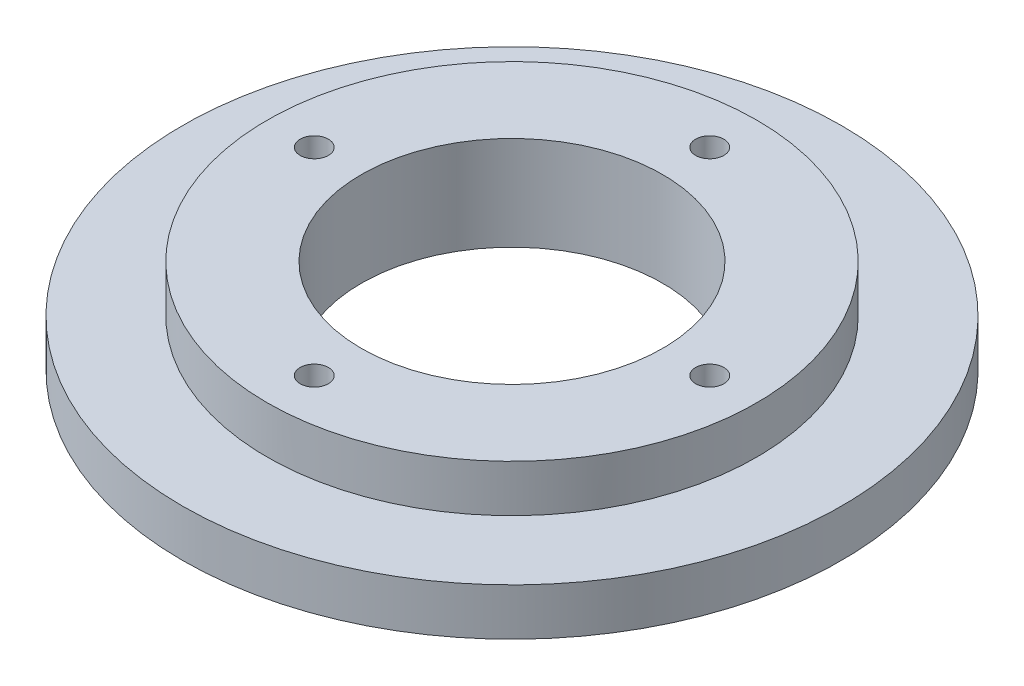
ISO-10303-21;
HEADER;
FILE_DESCRIPTION(('STEP AP214'),'2;1');
FILE_NAME('part.step','',(''),(''),'','','');
FILE_SCHEMA(('AUTOMOTIVE_DESIGN { 1 0 10303 214 1 1 1 1 }'));
ENDSEC;
DATA;
#1=APPLICATION_CONTEXT('core data for automotive mechanical design processes');
#2=APPLICATION_PROTOCOL_DEFINITION('international standard','automotive_design',2000,#1);
#3=PRODUCT_CONTEXT('',#1,'mechanical');
#4=PRODUCT('Part','Part','',(#3));
#5=PRODUCT_RELATED_PRODUCT_CATEGORY('part','',(#4));
#6=PRODUCT_DEFINITION_FORMATION('','',#4);
#7=PRODUCT_DEFINITION_CONTEXT('part definition',#1,'design');
#8=PRODUCT_DEFINITION('design','',#6,#7);
#9=PRODUCT_DEFINITION_SHAPE('','',#8);
#10=(LENGTH_UNIT() NAMED_UNIT(*) SI_UNIT(.MILLI.,.METRE.));
#11=(NAMED_UNIT(*) PLANE_ANGLE_UNIT() SI_UNIT($,.RADIAN.));
#12=(NAMED_UNIT(*) SI_UNIT($,.STERADIAN.) SOLID_ANGLE_UNIT());
#13=UNCERTAINTY_MEASURE_WITH_UNIT(LENGTH_MEASURE(1.E-05),#10,'distance_accuracy_value','');
#14=(GEOMETRIC_REPRESENTATION_CONTEXT(3) GLOBAL_UNCERTAINTY_ASSIGNED_CONTEXT((#13)) GLOBAL_UNIT_ASSIGNED_CONTEXT((#10,
#11,#12)) REPRESENTATION_CONTEXT('',''));
#15=CARTESIAN_POINT('',(0.,0.,0.));
#16=DIRECTION('',(0.,0.,1.));
#17=DIRECTION('',(1.,0.,0.));
#18=AXIS2_PLACEMENT_3D('',#15,#16,#17);
#19=CARTESIAN_POINT('',(21.,-25.,0.));
#20=DIRECTION('',(0.,1.,0.));
#21=DIRECTION('',(0.,0.,1.));
#22=AXIS2_PLACEMENT_3D('',#19,#20,#21);
#23=CYLINDRICAL_SURFACE('',#22,1.5);
#24=CARTESIAN_POINT('',(21.,10.,0.));
#25=DIRECTION('',(0.,1.,0.));
#26=DIRECTION('',(0.,0.,1.));
#27=AXIS2_PLACEMENT_3D('',#24,#25,#26);
#28=CIRCLE('',#27,1.5);
#29=CARTESIAN_POINT('',(21.,10.,1.5));
#30=VERTEX_POINT('',#29);
#31=EDGE_CURVE('E403',#30,#30,#28,.T.);
#32=ORIENTED_EDGE('',*,*,#31,.T.);
#33=EDGE_LOOP('',(#32));
#34=FACE_BOUND('',#33,.T.);
#35=CARTESIAN_POINT('',(21.,3.,0.));
#36=DIRECTION('',(0.,-1.,0.));
#37=DIRECTION('',(0.,0.,-1.));
#38=AXIS2_PLACEMENT_3D('',#35,#36,#37);
#39=CIRCLE('',#38,1.5);
#40=CARTESIAN_POINT('',(21.,3.,-1.5));
#41=VERTEX_POINT('',#40);
#42=EDGE_CURVE('E36',#41,#41,#39,.F.);
#43=ORIENTED_EDGE('',*,*,#42,.F.);
#44=EDGE_LOOP('',(#43));
#45=FACE_BOUND('',#44,.T.);
#46=ADVANCED_FACE('F32',(#34,#45),#23,.F.);
#47=CARTESIAN_POINT('',(-21.,-25.,0.));
#48=DIRECTION('',(0.,1.,0.));
#49=DIRECTION('',(0.,0.,1.));
#50=AXIS2_PLACEMENT_3D('',#47,#48,#49);
#51=CYLINDRICAL_SURFACE('',#50,1.5);
#52=CARTESIAN_POINT('',(-21.,10.,0.));
#53=DIRECTION('',(0.,1.,0.));
#54=DIRECTION('',(0.,0.,1.));
#55=AXIS2_PLACEMENT_3D('',#52,#53,#54);
#56=CIRCLE('',#55,1.5);
#57=CARTESIAN_POINT('',(-21.,10.,1.5));
#58=VERTEX_POINT('',#57);
#59=EDGE_CURVE('E400',#58,#58,#56,.T.);
#60=ORIENTED_EDGE('',*,*,#59,.T.);
#61=EDGE_LOOP('',(#60));
#62=FACE_BOUND('',#61,.T.);
#63=CARTESIAN_POINT('',(-21.,3.,0.));
#64=DIRECTION('',(0.,-1.,0.));
#65=DIRECTION('',(0.,0.,-1.));
#66=AXIS2_PLACEMENT_3D('',#63,#64,#65);
#67=CIRCLE('',#66,1.5);
#68=CARTESIAN_POINT('',(-21.,3.,-1.5));
#69=VERTEX_POINT('',#68);
#70=EDGE_CURVE('E423',#69,#69,#67,.F.);
#71=ORIENTED_EDGE('',*,*,#70,.F.);
#72=EDGE_LOOP('',(#71));
#73=FACE_BOUND('',#72,.T.);
#74=ADVANCED_FACE('F431',(#62,#73),#51,.F.);
#75=CARTESIAN_POINT('',(0.,-25.,-21.));
#76=DIRECTION('',(0.,1.,0.));
#77=DIRECTION('',(0.,0.,1.));
#78=AXIS2_PLACEMENT_3D('',#75,#76,#77);
#79=CYLINDRICAL_SURFACE('',#78,1.5);
#80=CARTESIAN_POINT('',(0.,10.,-21.));
#81=DIRECTION('',(0.,1.,0.));
#82=DIRECTION('',(0.,0.,1.));
#83=AXIS2_PLACEMENT_3D('',#80,#81,#82);
#84=CIRCLE('',#83,1.5);
#85=CARTESIAN_POINT('',(0.,10.,-19.5));
#86=VERTEX_POINT('',#85);
#87=EDGE_CURVE('E397',#86,#86,#84,.T.);
#88=ORIENTED_EDGE('',*,*,#87,.T.);
#89=EDGE_LOOP('',(#88));
#90=FACE_BOUND('',#89,.T.);
#91=CARTESIAN_POINT('',(0.,3.,-21.));
#92=DIRECTION('',(0.,-1.,0.));
#93=DIRECTION('',(0.,0.,-1.));
#94=AXIS2_PLACEMENT_3D('',#91,#92,#93);
#95=CIRCLE('',#94,1.5);
#96=CARTESIAN_POINT('',(0.,3.,-22.5));
#97=VERTEX_POINT('',#96);
#98=EDGE_CURVE('E421',#97,#97,#95,.F.);
#99=ORIENTED_EDGE('',*,*,#98,.F.);
#100=EDGE_LOOP('',(#99));
#101=FACE_BOUND('',#100,.T.);
#102=ADVANCED_FACE('F437',(#90,#101),#79,.F.);
#103=CARTESIAN_POINT('',(0.,-25.,21.));
#104=DIRECTION('',(0.,1.,0.));
#105=DIRECTION('',(0.,0.,1.));
#106=AXIS2_PLACEMENT_3D('',#103,#104,#105);
#107=CYLINDRICAL_SURFACE('',#106,1.5);
#108=CARTESIAN_POINT('',(0.,10.,21.));
#109=DIRECTION('',(0.,1.,0.));
#110=DIRECTION('',(0.,0.,1.));
#111=AXIS2_PLACEMENT_3D('',#108,#109,#110);
#112=CIRCLE('',#111,1.5);
#113=CARTESIAN_POINT('',(0.,10.,22.5));
#114=VERTEX_POINT('',#113);
#115=EDGE_CURVE('E393',#114,#114,#112,.T.);
#116=ORIENTED_EDGE('',*,*,#115,.T.);
#117=EDGE_LOOP('',(#116));
#118=FACE_BOUND('',#117,.T.);
#119=CARTESIAN_POINT('',(0.,3.,21.));
#120=DIRECTION('',(0.,-1.,0.));
#121=DIRECTION('',(0.,0.,-1.));
#122=AXIS2_PLACEMENT_3D('',#119,#120,#121);
#123=CIRCLE('',#122,1.5);
#124=CARTESIAN_POINT('',(0.,3.,19.5));
#125=VERTEX_POINT('',#124);
#126=EDGE_CURVE('E244',#125,#125,#123,.F.);
#127=ORIENTED_EDGE('',*,*,#126,.F.);
#128=EDGE_LOOP('',(#127));
#129=FACE_BOUND('',#128,.T.);
#130=ADVANCED_FACE('F508',(#118,#129),#107,.F.);
#131=CARTESIAN_POINT('',(0.,10.,0.));
#132=DIRECTION('',(0.,-1.,0.));
#133=DIRECTION('',(0.,0.,-1.));
#134=AXIS2_PLACEMENT_3D('',#131,#132,#133);
#135=CYLINDRICAL_SURFACE('',#134,26.);
#136=CARTESIAN_POINT('',(0.,10.,0.));
#137=DIRECTION('',(0.,1.,0.));
#138=DIRECTION('',(0.,0.,1.));
#139=AXIS2_PLACEMENT_3D('',#136,#137,#138);
#140=CIRCLE('',#139,26.);
#141=CARTESIAN_POINT('',(0.,10.,26.));
#142=VERTEX_POINT('',#141);
#143=EDGE_CURVE('E41',#142,#142,#140,.T.);
#144=ORIENTED_EDGE('',*,*,#143,.F.);
#145=EDGE_LOOP('',(#144));
#146=FACE_BOUND('',#145,.T.);
#147=CARTESIAN_POINT('',(0.,5.,0.));
#148=DIRECTION('',(0.,-1.,0.));
#149=DIRECTION('',(0.,0.,-1.));
#150=AXIS2_PLACEMENT_3D('',#147,#148,#149);
#151=CIRCLE('',#150,26.);
#152=CARTESIAN_POINT('',(0.,5.,-26.));
#153=VERTEX_POINT('',#152);
#154=EDGE_CURVE('E11',#153,#153,#151,.T.);
#155=ORIENTED_EDGE('',*,*,#154,.F.);
#156=EDGE_LOOP('',(#155));
#157=FACE_BOUND('',#156,.T.);
#158=ADVANCED_FACE('F34',(#146,#157),#135,.T.);
#159=CARTESIAN_POINT('',(0.,10.,0.));
#160=DIRECTION('',(0.,-1.,0.));
#161=DIRECTION('',(0.,0.,-1.));
#162=AXIS2_PLACEMENT_3D('',#159,#160,#161);
#163=CYLINDRICAL_SURFACE('',#162,16.);
#164=CARTESIAN_POINT('',(0.,10.,0.));
#165=DIRECTION('',(0.,1.,0.));
#166=DIRECTION('',(0.,0.,1.));
#167=AXIS2_PLACEMENT_3D('',#164,#165,#166);
#168=CIRCLE('',#167,16.);
#169=CARTESIAN_POINT('',(0.,10.,16.));
#170=VERTEX_POINT('',#169);
#171=EDGE_CURVE('E412',#170,#170,#168,.T.);
#172=ORIENTED_EDGE('',*,*,#171,.T.);
#173=EDGE_LOOP('',(#172));
#174=FACE_BOUND('',#173,.T.);
#175=CARTESIAN_POINT('',(0.,0.,0.));
#176=DIRECTION('',(0.,1.,0.));
#177=DIRECTION('',(0.,0.,1.));
#178=AXIS2_PLACEMENT_3D('',#175,#176,#177);
#179=CIRCLE('',#178,16.);
#180=CARTESIAN_POINT('',(0.,0.,16.));
#181=VERTEX_POINT('',#180);
#182=EDGE_CURVE('E396',#181,#181,#179,.T.);
#183=ORIENTED_EDGE('',*,*,#182,.F.);
#184=EDGE_LOOP('',(#183));
#185=FACE_BOUND('',#184,.T.);
#186=ADVANCED_FACE('F452',(#174,#185),#163,.F.);
#187=CARTESIAN_POINT('',(0.,10.,0.));
#188=DIRECTION('',(0.,1.,0.));
#189=DIRECTION('',(0.,0.,1.));
#190=AXIS2_PLACEMENT_3D('',#187,#188,#189);
#191=PLANE('',#190);
#192=ORIENTED_EDGE('',*,*,#115,.F.);
#193=EDGE_LOOP('',(#192));
#194=FACE_BOUND('',#193,.T.);
#195=ORIENTED_EDGE('',*,*,#87,.F.);
#196=EDGE_LOOP('',(#195));
#197=FACE_BOUND('',#196,.T.);
#198=ORIENTED_EDGE('',*,*,#59,.F.);
#199=EDGE_LOOP('',(#198));
#200=FACE_BOUND('',#199,.T.);
#201=ORIENTED_EDGE('',*,*,#31,.F.);
#202=EDGE_LOOP('',(#201));
#203=FACE_BOUND('',#202,.T.);
#204=ORIENTED_EDGE('',*,*,#143,.T.);
#205=EDGE_LOOP('',(#204));
#206=FACE_BOUND('',#205,.T.);
#207=ORIENTED_EDGE('',*,*,#171,.F.);
#208=EDGE_LOOP('',(#207));
#209=FACE_BOUND('',#208,.T.);
#210=ADVANCED_FACE('F450',(#194,#197,#200,#203,#206,#209),#191,.T.);
#211=CARTESIAN_POINT('',(0.,5.,0.));
#212=DIRECTION('',(0.,-1.,0.));
#213=DIRECTION('',(0.,0.,-1.));
#214=AXIS2_PLACEMENT_3D('',#211,#212,#213);
#215=CYLINDRICAL_SURFACE('',#214,35.);
#216=CARTESIAN_POINT('',(0.,5.,0.));
#217=DIRECTION('',(0.,-1.,0.));
#218=DIRECTION('',(0.,0.,-1.));
#219=AXIS2_PLACEMENT_3D('',#216,#217,#218);
#220=CIRCLE('',#219,35.);
#221=CARTESIAN_POINT('',(0.,5.,-35.));
#222=VERTEX_POINT('',#221);
#223=EDGE_CURVE('E409',#222,#222,#220,.T.);
#224=ORIENTED_EDGE('',*,*,#223,.T.);
#225=EDGE_LOOP('',(#224));
#226=FACE_BOUND('',#225,.T.);
#227=CARTESIAN_POINT('',(0.,0.,0.));
#228=DIRECTION('',(0.,-1.,0.));
#229=DIRECTION('',(0.,0.,-1.));
#230=AXIS2_PLACEMENT_3D('',#227,#228,#229);
#231=CIRCLE('',#230,35.);
#232=CARTESIAN_POINT('',(0.,0.,-35.));
#233=VERTEX_POINT('',#232);
#234=EDGE_CURVE('E408',#233,#233,#231,.T.);
#235=ORIENTED_EDGE('',*,*,#234,.F.);
#236=EDGE_LOOP('',(#235));
#237=FACE_BOUND('',#236,.T.);
#238=ADVANCED_FACE('F446',(#226,#237),#215,.T.);
#239=CARTESIAN_POINT('',(0.,5.,0.));
#240=DIRECTION('',(0.,-1.,0.));
#241=DIRECTION('',(0.,0.,-1.));
#242=AXIS2_PLACEMENT_3D('',#239,#240,#241);
#243=PLANE('',#242);
#244=ORIENTED_EDGE('',*,*,#154,.T.);
#245=EDGE_LOOP('',(#244));
#246=FACE_BOUND('',#245,.T.);
#247=ORIENTED_EDGE('',*,*,#223,.F.);
#248=EDGE_LOOP('',(#247));
#249=FACE_BOUND('',#248,.T.);
#250=ADVANCED_FACE('F442',(#246,#249),#243,.F.);
#251=CARTESIAN_POINT('',(0.,0.,0.));
#252=DIRECTION('',(0.,1.,0.));
#253=DIRECTION('',(0.,0.,1.));
#254=AXIS2_PLACEMENT_3D('',#251,#252,#253);
#255=PLANE('',#254);
#256=DIRECTION('',(-0.500000000000001,0.,0.866025403784438));
#257=VECTOR('',#256,1.);
#258=CARTESIAN_POINT('',(24.0310889132455,0.,0.));
#259=LINE('',#258,#257);
#260=CARTESIAN_POINT('',(24.0310889132455,0.,0.));
#261=VERTEX_POINT('',#260);
#262=CARTESIAN_POINT('',(22.5155444566228,0.,2.625));
#263=VERTEX_POINT('',#262);
#264=EDGE_CURVE('E231',#261,#263,#259,.T.);
#265=ORIENTED_EDGE('',*,*,#264,.F.);
#266=DIRECTION('',(0.5,0.,0.866025403784438));
#267=VECTOR('',#266,1.);
#268=CARTESIAN_POINT('',(22.5155444566228,0.,-2.625));
#269=LINE('',#268,#267);
#270=CARTESIAN_POINT('',(22.5155444566228,0.,-2.625));
#271=VERTEX_POINT('',#270);
#272=EDGE_CURVE('E49',#271,#261,#269,.T.);
#273=ORIENTED_EDGE('',*,*,#272,.F.);
#274=DIRECTION('',(1.,0.,0.));
#275=VECTOR('',#274,1.);
#276=CARTESIAN_POINT('',(19.4844555433772,0.,-2.625));
#277=LINE('',#276,#275);
#278=CARTESIAN_POINT('',(19.4844555433772,0.,-2.625));
#279=VERTEX_POINT('',#278);
#280=EDGE_CURVE('E217',#279,#271,#277,.T.);
#281=ORIENTED_EDGE('',*,*,#280,.F.);
#282=DIRECTION('',(0.5,0.,-0.866025403784438));
#283=VECTOR('',#282,1.);
#284=CARTESIAN_POINT('',(17.9689110867545,0.,0.));
#285=LINE('',#284,#283);
#286=CARTESIAN_POINT('',(17.9689110867545,0.,0.));
#287=VERTEX_POINT('',#286);
#288=EDGE_CURVE('E220',#287,#279,#285,.T.);
#289=ORIENTED_EDGE('',*,*,#288,.F.);
#290=DIRECTION('',(-0.5,0.,-0.866025403784438));
#291=VECTOR('',#290,1.);
#292=CARTESIAN_POINT('',(19.4844555433772,0.,2.625));
#293=LINE('',#292,#291);
#294=CARTESIAN_POINT('',(19.4844555433772,0.,2.625));
#295=VERTEX_POINT('',#294);
#296=EDGE_CURVE('E237',#295,#287,#293,.T.);
#297=ORIENTED_EDGE('',*,*,#296,.F.);
#298=DIRECTION('',(-1.,0.,0.));
#299=VECTOR('',#298,1.);
#300=CARTESIAN_POINT('',(22.5155444566228,0.,2.625));
#301=LINE('',#300,#299);
#302=EDGE_CURVE('E234',#263,#295,#301,.T.);
#303=ORIENTED_EDGE('',*,*,#302,.F.);
#304=EDGE_LOOP('',(#265,#273,#281,#289,#297,#303));
#305=FACE_BOUND('',#304,.T.);
#306=DIRECTION('',(-0.5,0.,0.866025403784438));
#307=VECTOR('',#306,1.);
#308=CARTESIAN_POINT('',(3.03108891324554,0.,-21.));
#309=LINE('',#308,#307);
#310=CARTESIAN_POINT('',(3.03108891324554,0.,-21.));
#311=VERTEX_POINT('',#310);
#312=CARTESIAN_POINT('',(1.51554445662277,0.,-18.375));
#313=VERTEX_POINT('',#312);
#314=EDGE_CURVE('E273',#311,#313,#309,.T.);
#315=ORIENTED_EDGE('',*,*,#314,.F.);
#316=DIRECTION('',(0.5,0.,0.866025403784439));
#317=VECTOR('',#316,1.);
#318=CARTESIAN_POINT('',(1.51554445662277,0.,-23.625));
#319=LINE('',#318,#317);
#320=CARTESIAN_POINT('',(1.51554445662277,0.,-23.625));
#321=VERTEX_POINT('',#320);
#322=EDGE_CURVE('E57',#321,#311,#319,.T.);
#323=ORIENTED_EDGE('',*,*,#322,.F.);
#324=DIRECTION('',(1.,0.,0.));
#325=VECTOR('',#324,1.);
#326=CARTESIAN_POINT('',(-1.51554445662277,0.,-23.625));
#327=LINE('',#326,#325);
#328=CARTESIAN_POINT('',(-1.51554445662277,0.,-23.625));
#329=VERTEX_POINT('',#328);
#330=EDGE_CURVE('E256',#329,#321,#327,.T.);
#331=ORIENTED_EDGE('',*,*,#330,.F.);
#332=DIRECTION('',(0.5,0.,-0.866025403784439));
#333=VECTOR('',#332,1.);
#334=CARTESIAN_POINT('',(-3.03108891324554,0.,-21.));
#335=LINE('',#334,#333);
#336=CARTESIAN_POINT('',(-3.03108891324554,0.,-21.));
#337=VERTEX_POINT('',#336);
#338=EDGE_CURVE('E283',#337,#329,#335,.T.);
#339=ORIENTED_EDGE('',*,*,#338,.F.);
#340=DIRECTION('',(-0.5,0.,-0.866025403784438));
#341=VECTOR('',#340,1.);
#342=CARTESIAN_POINT('',(-1.51554445662277,0.,-18.375));
#343=LINE('',#342,#341);
#344=CARTESIAN_POINT('',(-1.51554445662277,0.,-18.375));
#345=VERTEX_POINT('',#344);
#346=EDGE_CURVE('E280',#345,#337,#343,.T.);
#347=ORIENTED_EDGE('',*,*,#346,.F.);
#348=DIRECTION('',(-1.,0.,0.));
#349=VECTOR('',#348,1.);
#350=CARTESIAN_POINT('',(1.51554445662277,0.,-18.375));
#351=LINE('',#350,#349);
#352=EDGE_CURVE('E277',#313,#345,#351,.T.);
#353=ORIENTED_EDGE('',*,*,#352,.F.);
#354=EDGE_LOOP('',(#315,#323,#331,#339,#347,#353));
#355=FACE_BOUND('',#354,.T.);
#356=DIRECTION('',(-0.5,0.,0.866025403784438));
#357=VECTOR('',#356,1.);
#358=CARTESIAN_POINT('',(-17.9689110867545,0.,0.));
#359=LINE('',#358,#357);
#360=CARTESIAN_POINT('',(-17.9689110867545,0.,0.));
#361=VERTEX_POINT('',#360);
#362=CARTESIAN_POINT('',(-19.4844555433772,0.,2.625));
#363=VERTEX_POINT('',#362);
#364=EDGE_CURVE('E320',#361,#363,#359,.T.);
#365=ORIENTED_EDGE('',*,*,#364,.F.);
#366=DIRECTION('',(0.5,0.,0.866025403784439));
#367=VECTOR('',#366,1.);
#368=CARTESIAN_POINT('',(-19.4844555433772,0.,-2.625));
#369=LINE('',#368,#367);
#370=CARTESIAN_POINT('',(-19.4844555433772,0.,-2.625));
#371=VERTEX_POINT('',#370);
#372=EDGE_CURVE('E318',#371,#361,#369,.T.);
#373=ORIENTED_EDGE('',*,*,#372,.F.);
#374=DIRECTION('',(1.,0.,0.));
#375=VECTOR('',#374,1.);
#376=CARTESIAN_POINT('',(-22.5155444566228,0.,-2.625));
#377=LINE('',#376,#375);
#378=CARTESIAN_POINT('',(-22.5155444566228,0.,-2.625));
#379=VERTEX_POINT('',#378);
#380=EDGE_CURVE('E302',#379,#371,#377,.T.);
#381=ORIENTED_EDGE('',*,*,#380,.F.);
#382=DIRECTION('',(0.5,0.,-0.866025403784439));
#383=VECTOR('',#382,1.);
#384=CARTESIAN_POINT('',(-24.0310889132455,0.,0.));
#385=LINE('',#384,#383);
#386=CARTESIAN_POINT('',(-24.0310889132455,0.,0.));
#387=VERTEX_POINT('',#386);
#388=EDGE_CURVE('E330',#387,#379,#385,.T.);
#389=ORIENTED_EDGE('',*,*,#388,.F.);
#390=DIRECTION('',(-0.5,0.,-0.866025403784438));
#391=VECTOR('',#390,1.);
#392=CARTESIAN_POINT('',(-22.5155444566228,0.,2.625));
#393=LINE('',#392,#391);
#394=CARTESIAN_POINT('',(-22.5155444566228,0.,2.625));
#395=VERTEX_POINT('',#394);
#396=EDGE_CURVE('E327',#395,#387,#393,.T.);
#397=ORIENTED_EDGE('',*,*,#396,.F.);
#398=DIRECTION('',(-1.,0.,0.));
#399=VECTOR('',#398,1.);
#400=CARTESIAN_POINT('',(-19.4844555433772,0.,2.625));
#401=LINE('',#400,#399);
#402=EDGE_CURVE('E324',#363,#395,#401,.T.);
#403=ORIENTED_EDGE('',*,*,#402,.F.);
#404=EDGE_LOOP('',(#365,#373,#381,#389,#397,#403));
#405=FACE_BOUND('',#404,.T.);
#406=DIRECTION('',(-0.5,0.,0.866025403784439));
#407=VECTOR('',#406,1.);
#408=CARTESIAN_POINT('',(3.03108891324554,0.,21.));
#409=LINE('',#408,#407);
#410=CARTESIAN_POINT('',(3.03108891324554,0.,21.));
#411=VERTEX_POINT('',#410);
#412=CARTESIAN_POINT('',(1.51554445662277,0.,23.625));
#413=VERTEX_POINT('',#412);
#414=EDGE_CURVE('E368',#411,#413,#409,.T.);
#415=ORIENTED_EDGE('',*,*,#414,.F.);
#416=DIRECTION('',(0.5,0.,0.866025403784439));
#417=VECTOR('',#416,1.);
#418=CARTESIAN_POINT('',(1.51554445662277,0.,18.375));
#419=LINE('',#418,#417);
#420=CARTESIAN_POINT('',(1.51554445662277,0.,18.375));
#421=VERTEX_POINT('',#420);
#422=EDGE_CURVE('E366',#421,#411,#419,.T.);
#423=ORIENTED_EDGE('',*,*,#422,.F.);
#424=DIRECTION('',(1.,0.,0.));
#425=VECTOR('',#424,1.);
#426=CARTESIAN_POINT('',(-1.51554445662276,0.,18.375));
#427=LINE('',#426,#425);
#428=CARTESIAN_POINT('',(-1.51554445662276,0.,18.375));
#429=VERTEX_POINT('',#428);
#430=EDGE_CURVE('E350',#429,#421,#427,.T.);
#431=ORIENTED_EDGE('',*,*,#430,.F.);
#432=DIRECTION('',(0.5,0.,-0.866025403784439));
#433=VECTOR('',#432,1.);
#434=CARTESIAN_POINT('',(-3.03108891324553,0.,21.));
#435=LINE('',#434,#433);
#436=CARTESIAN_POINT('',(-3.03108891324553,0.,21.));
#437=VERTEX_POINT('',#436);
#438=EDGE_CURVE('E377',#437,#429,#435,.T.);
#439=ORIENTED_EDGE('',*,*,#438,.F.);
#440=DIRECTION('',(-0.5,0.,-0.866025403784439));
#441=VECTOR('',#440,1.);
#442=CARTESIAN_POINT('',(-1.51554445662277,0.,23.625));
#443=LINE('',#442,#441);
#444=CARTESIAN_POINT('',(-1.51554445662277,0.,23.625));
#445=VERTEX_POINT('',#444);
#446=EDGE_CURVE('E374',#445,#437,#443,.T.);
#447=ORIENTED_EDGE('',*,*,#446,.F.);
#448=DIRECTION('',(-1.,0.,0.));
#449=VECTOR('',#448,1.);
#450=CARTESIAN_POINT('',(1.51554445662277,0.,23.625));
#451=LINE('',#450,#449);
#452=EDGE_CURVE('E371',#413,#445,#451,.T.);
#453=ORIENTED_EDGE('',*,*,#452,.F.);
#454=EDGE_LOOP('',(#415,#423,#431,#439,#447,#453));
#455=FACE_BOUND('',#454,.T.);
#456=ORIENTED_EDGE('',*,*,#182,.T.);
#457=EDGE_LOOP('',(#456));
#458=FACE_BOUND('',#457,.T.);
#459=ORIENTED_EDGE('',*,*,#234,.T.);
#460=EDGE_LOOP('',(#459));
#461=FACE_BOUND('',#460,.T.);
#462=ADVANCED_FACE('F445',(#305,#355,#405,#455,#458,#461),#255,.F.);
#463=CARTESIAN_POINT('',(0.,3.,0.));
#464=DIRECTION('',(0.,-1.,0.));
#465=DIRECTION('',(0.,0.,-1.));
#466=AXIS2_PLACEMENT_3D('',#463,#464,#465);
#467=PLANE('',#466);
#468=DIRECTION('',(0.5,0.,0.866025403784439));
#469=VECTOR('',#468,1.);
#470=CARTESIAN_POINT('',(1.51554445662277,3.,18.375));
#471=LINE('',#470,#469);
#472=CARTESIAN_POINT('',(1.51554445662277,3.,18.375));
#473=VERTEX_POINT('',#472);
#474=CARTESIAN_POINT('',(3.03108891324554,3.,21.));
#475=VERTEX_POINT('',#474);
#476=EDGE_CURVE('E346',#473,#475,#471,.T.);
#477=ORIENTED_EDGE('',*,*,#476,.T.);
#478=DIRECTION('',(-0.5,0.,0.866025403784439));
#479=VECTOR('',#478,1.);
#480=CARTESIAN_POINT('',(3.03108891324554,3.,21.));
#481=LINE('',#480,#479);
#482=CARTESIAN_POINT('',(1.51554445662277,3.,23.625));
#483=VERTEX_POINT('',#482);
#484=EDGE_CURVE('E349',#475,#483,#481,.T.);
#485=ORIENTED_EDGE('',*,*,#484,.T.);
#486=DIRECTION('',(-1.,0.,0.));
#487=VECTOR('',#486,1.);
#488=CARTESIAN_POINT('',(1.51554445662277,3.,23.625));
#489=LINE('',#488,#487);
#490=CARTESIAN_POINT('',(-1.51554445662277,3.,23.625));
#491=VERTEX_POINT('',#490);
#492=EDGE_CURVE('E353',#483,#491,#489,.T.);
#493=ORIENTED_EDGE('',*,*,#492,.T.);
#494=DIRECTION('',(-0.5,0.,-0.866025403784439));
#495=VECTOR('',#494,1.);
#496=CARTESIAN_POINT('',(-1.51554445662277,3.,23.625));
#497=LINE('',#496,#495);
#498=CARTESIAN_POINT('',(-3.03108891324553,3.,21.));
#499=VERTEX_POINT('',#498);
#500=EDGE_CURVE('E356',#491,#499,#497,.T.);
#501=ORIENTED_EDGE('',*,*,#500,.T.);
#502=DIRECTION('',(0.5,0.,-0.866025403784439));
#503=VECTOR('',#502,1.);
#504=CARTESIAN_POINT('',(-3.03108891324553,3.,21.));
#505=LINE('',#504,#503);
#506=CARTESIAN_POINT('',(-1.51554445662276,3.,18.375));
#507=VERTEX_POINT('',#506);
#508=EDGE_CURVE('E359',#499,#507,#505,.T.);
#509=ORIENTED_EDGE('',*,*,#508,.T.);
#510=DIRECTION('',(1.,0.,0.));
#511=VECTOR('',#510,1.);
#512=CARTESIAN_POINT('',(-1.51554445662276,3.,18.375));
#513=LINE('',#512,#511);
#514=EDGE_CURVE('E362',#507,#473,#513,.T.);
#515=ORIENTED_EDGE('',*,*,#514,.T.);
#516=EDGE_LOOP('',(#477,#485,#493,#501,#509,#515));
#517=FACE_BOUND('',#516,.T.);
#518=ORIENTED_EDGE('',*,*,#126,.T.);
#519=EDGE_LOOP('',(#518));
#520=FACE_BOUND('',#519,.T.);
#521=ADVANCED_FACE('F459',(#517,#520),#467,.T.);
#522=CARTESIAN_POINT('',(1.51554445662277,3.,18.375));
#523=DIRECTION('',(0.866025403784439,0.,-0.5));
#524=DIRECTION('',(-0.5,0.,-0.866025403784439));
#525=AXIS2_PLACEMENT_3D('',#522,#523,#524);
#526=PLANE('',#525);
#527=ORIENTED_EDGE('',*,*,#422,.T.);
#528=DIRECTION('',(0.,-1.,0.));
#529=VECTOR('',#528,1.);
#530=CARTESIAN_POINT('',(3.03108891324554,3.,21.));
#531=LINE('',#530,#529);
#532=EDGE_CURVE('E365',#475,#411,#531,.T.);
#533=ORIENTED_EDGE('',*,*,#532,.F.);
#534=ORIENTED_EDGE('',*,*,#476,.F.);
#535=DIRECTION('',(0.,-1.,0.));
#536=VECTOR('',#535,1.);
#537=CARTESIAN_POINT('',(1.51554445662277,3.,18.375));
#538=LINE('',#537,#536);
#539=EDGE_CURVE('E321',#473,#421,#538,.T.);
#540=ORIENTED_EDGE('',*,*,#539,.T.);
#541=EDGE_LOOP('',(#527,#533,#534,#540));
#542=FACE_BOUND('',#541,.T.);
#543=ADVANCED_FACE('F464',(#542),#526,.F.);
#544=CARTESIAN_POINT('',(-1.51554445662276,3.,18.375));
#545=DIRECTION('',(0.,0.,-1.));
#546=DIRECTION('',(-1.,0.,0.));
#547=AXIS2_PLACEMENT_3D('',#544,#545,#546);
#548=PLANE('',#547);
#549=ORIENTED_EDGE('',*,*,#430,.T.);
#550=ORIENTED_EDGE('',*,*,#539,.F.);
#551=ORIENTED_EDGE('',*,*,#514,.F.);
#552=DIRECTION('',(0.,-1.,0.));
#553=VECTOR('',#552,1.);
#554=CARTESIAN_POINT('',(-1.51554445662276,3.,18.375));
#555=LINE('',#554,#553);
#556=EDGE_CURVE('E383',#507,#429,#555,.T.);
#557=ORIENTED_EDGE('',*,*,#556,.T.);
#558=EDGE_LOOP('',(#549,#550,#551,#557));
#559=FACE_BOUND('',#558,.T.);
#560=ADVANCED_FACE('F495',(#559),#548,.F.);
#561=CARTESIAN_POINT('',(-3.03108891324553,3.,21.));
#562=DIRECTION('',(-0.866025403784439,0.,-0.5));
#563=DIRECTION('',(-0.5,0.,0.866025403784439));
#564=AXIS2_PLACEMENT_3D('',#561,#562,#563);
#565=PLANE('',#564);
#566=ORIENTED_EDGE('',*,*,#438,.T.);
#567=ORIENTED_EDGE('',*,*,#556,.F.);
#568=ORIENTED_EDGE('',*,*,#508,.F.);
#569=DIRECTION('',(0.,-1.,0.));
#570=VECTOR('',#569,1.);
#571=CARTESIAN_POINT('',(-3.03108891324553,3.,21.));
#572=LINE('',#571,#570);
#573=EDGE_CURVE('E385',#499,#437,#572,.T.);
#574=ORIENTED_EDGE('',*,*,#573,.T.);
#575=EDGE_LOOP('',(#566,#567,#568,#574));
#576=FACE_BOUND('',#575,.T.);
#577=ADVANCED_FACE('F498',(#576),#565,.F.);
#578=CARTESIAN_POINT('',(-1.51554445662277,3.,23.625));
#579=DIRECTION('',(-0.866025403784439,0.,0.5));
#580=DIRECTION('',(0.5,0.,0.866025403784439));
#581=AXIS2_PLACEMENT_3D('',#578,#579,#580);
#582=PLANE('',#581);
#583=ORIENTED_EDGE('',*,*,#446,.T.);
#584=ORIENTED_EDGE('',*,*,#573,.F.);
#585=ORIENTED_EDGE('',*,*,#500,.F.);
#586=DIRECTION('',(0.,-1.,0.));
#587=VECTOR('',#586,1.);
#588=CARTESIAN_POINT('',(-1.51554445662277,3.,23.625));
#589=LINE('',#588,#587);
#590=EDGE_CURVE('E387',#491,#445,#589,.T.);
#591=ORIENTED_EDGE('',*,*,#590,.T.);
#592=EDGE_LOOP('',(#583,#584,#585,#591));
#593=FACE_BOUND('',#592,.T.);
#594=ADVANCED_FACE('F502',(#593),#582,.F.);
#595=CARTESIAN_POINT('',(1.51554445662277,3.,23.625));
#596=DIRECTION('',(0.,0.,1.));
#597=DIRECTION('',(1.,0.,0.));
#598=AXIS2_PLACEMENT_3D('',#595,#596,#597);
#599=PLANE('',#598);
#600=ORIENTED_EDGE('',*,*,#452,.T.);
#601=ORIENTED_EDGE('',*,*,#590,.F.);
#602=ORIENTED_EDGE('',*,*,#492,.F.);
#603=DIRECTION('',(0.,-1.,0.));
#604=VECTOR('',#603,1.);
#605=CARTESIAN_POINT('',(1.51554445662277,3.,23.625));
#606=LINE('',#605,#604);
#607=EDGE_CURVE('E389',#483,#413,#606,.T.);
#608=ORIENTED_EDGE('',*,*,#607,.T.);
#609=EDGE_LOOP('',(#600,#601,#602,#608));
#610=FACE_BOUND('',#609,.T.);
#611=ADVANCED_FACE('F504',(#610),#599,.F.);
#612=CARTESIAN_POINT('',(3.03108891324554,3.,21.));
#613=DIRECTION('',(0.866025403784438,0.,0.5));
#614=DIRECTION('',(0.5,0.,-0.866025403784439));
#615=AXIS2_PLACEMENT_3D('',#612,#613,#614);
#616=PLANE('',#615);
#617=ORIENTED_EDGE('',*,*,#414,.T.);
#618=ORIENTED_EDGE('',*,*,#607,.F.);
#619=ORIENTED_EDGE('',*,*,#484,.F.);
#620=ORIENTED_EDGE('',*,*,#532,.T.);
#621=EDGE_LOOP('',(#617,#618,#619,#620));
#622=FACE_BOUND('',#621,.T.);
#623=ADVANCED_FACE('F488',(#622),#616,.F.);
#624=CARTESIAN_POINT('',(0.,3.,0.));
#625=DIRECTION('',(0.,-1.,0.));
#626=DIRECTION('',(0.,0.,-1.));
#627=AXIS2_PLACEMENT_3D('',#624,#625,#626);
#628=PLANE('',#627);
#629=DIRECTION('',(0.5,0.,0.866025403784439));
#630=VECTOR('',#629,1.);
#631=CARTESIAN_POINT('',(1.51554445662277,3.,-23.625));
#632=LINE('',#631,#630);
#633=CARTESIAN_POINT('',(1.51554445662277,3.,-23.625));
#634=VERTEX_POINT('',#633);
#635=CARTESIAN_POINT('',(3.03108891324554,3.,-21.));
#636=VERTEX_POINT('',#635);
#637=EDGE_CURVE('E252',#634,#636,#632,.T.);
#638=ORIENTED_EDGE('',*,*,#637,.T.);
#639=DIRECTION('',(-0.5,0.,0.866025403784438));
#640=VECTOR('',#639,1.);
#641=CARTESIAN_POINT('',(3.03108891324554,3.,-21.));
#642=LINE('',#641,#640);
#643=CARTESIAN_POINT('',(1.51554445662277,3.,-18.375));
#644=VERTEX_POINT('',#643);
#645=EDGE_CURVE('E255',#636,#644,#642,.T.);
#646=ORIENTED_EDGE('',*,*,#645,.T.);
#647=DIRECTION('',(-1.,0.,0.));
#648=VECTOR('',#647,1.);
#649=CARTESIAN_POINT('',(1.51554445662277,3.,-18.375));
#650=LINE('',#649,#648);
#651=CARTESIAN_POINT('',(-1.51554445662277,3.,-18.375));
#652=VERTEX_POINT('',#651);
#653=EDGE_CURVE('E259',#644,#652,#650,.T.);
#654=ORIENTED_EDGE('',*,*,#653,.T.);
#655=DIRECTION('',(-0.5,0.,-0.866025403784438));
#656=VECTOR('',#655,1.);
#657=CARTESIAN_POINT('',(-1.51554445662277,3.,-18.375));
#658=LINE('',#657,#656);
#659=CARTESIAN_POINT('',(-3.03108891324554,3.,-21.));
#660=VERTEX_POINT('',#659);
#661=EDGE_CURVE('E262',#652,#660,#658,.T.);
#662=ORIENTED_EDGE('',*,*,#661,.T.);
#663=DIRECTION('',(0.5,0.,-0.866025403784439));
#664=VECTOR('',#663,1.);
#665=CARTESIAN_POINT('',(-3.03108891324554,3.,-21.));
#666=LINE('',#665,#664);
#667=CARTESIAN_POINT('',(-1.51554445662277,3.,-23.625));
#668=VERTEX_POINT('',#667);
#669=EDGE_CURVE('E265',#660,#668,#666,.T.);
#670=ORIENTED_EDGE('',*,*,#669,.T.);
#671=DIRECTION('',(1.,0.,0.));
#672=VECTOR('',#671,1.);
#673=CARTESIAN_POINT('',(-1.51554445662277,3.,-23.625));
#674=LINE('',#673,#672);
#675=EDGE_CURVE('E268',#668,#634,#674,.T.);
#676=ORIENTED_EDGE('',*,*,#675,.T.);
#677=EDGE_LOOP('',(#638,#646,#654,#662,#670,#676));
#678=FACE_BOUND('',#677,.T.);
#679=ORIENTED_EDGE('',*,*,#98,.T.);
#680=EDGE_LOOP('',(#679));
#681=FACE_BOUND('',#680,.T.);
#682=ADVANCED_FACE('F523',(#678,#681),#628,.T.);
#683=CARTESIAN_POINT('',(1.51554445662277,3.,-23.625));
#684=DIRECTION('',(0.866025403784438,0.,-0.5));
#685=DIRECTION('',(-0.5,0.,-0.866025403784439));
#686=AXIS2_PLACEMENT_3D('',#683,#684,#685);
#687=PLANE('',#686);
#688=ORIENTED_EDGE('',*,*,#322,.T.);
#689=DIRECTION('',(0.,-1.,0.));
#690=VECTOR('',#689,1.);
#691=CARTESIAN_POINT('',(3.03108891324554,3.,-21.));
#692=LINE('',#691,#690);
#693=EDGE_CURVE('E271',#636,#311,#692,.T.);
#694=ORIENTED_EDGE('',*,*,#693,.F.);
#695=ORIENTED_EDGE('',*,*,#637,.F.);
#696=DIRECTION('',(0.,-1.,0.));
#697=VECTOR('',#696,1.);
#698=CARTESIAN_POINT('',(1.51554445662277,3.,-23.625));
#699=LINE('',#698,#697);
#700=EDGE_CURVE('E232',#634,#321,#699,.T.);
#701=ORIENTED_EDGE('',*,*,#700,.T.);
#702=EDGE_LOOP('',(#688,#694,#695,#701));
#703=FACE_BOUND('',#702,.T.);
#704=ADVANCED_FACE('F561',(#703),#687,.F.);
#705=CARTESIAN_POINT('',(-1.51554445662277,3.,-23.625));
#706=DIRECTION('',(0.,0.,-1.));
#707=DIRECTION('',(-1.,0.,0.));
#708=AXIS2_PLACEMENT_3D('',#705,#706,#707);
#709=PLANE('',#708);
#710=ORIENTED_EDGE('',*,*,#330,.T.);
#711=ORIENTED_EDGE('',*,*,#700,.F.);
#712=ORIENTED_EDGE('',*,*,#675,.F.);
#713=DIRECTION('',(0.,-1.,0.));
#714=VECTOR('',#713,1.);
#715=CARTESIAN_POINT('',(-1.51554445662277,3.,-23.625));
#716=LINE('',#715,#714);
#717=EDGE_CURVE('E289',#668,#329,#716,.T.);
#718=ORIENTED_EDGE('',*,*,#717,.T.);
#719=EDGE_LOOP('',(#710,#711,#712,#718));
#720=FACE_BOUND('',#719,.T.);
#721=ADVANCED_FACE('F564',(#720),#709,.F.);
#722=CARTESIAN_POINT('',(-3.03108891324554,3.,-21.));
#723=DIRECTION('',(-0.866025403784439,0.,-0.5));
#724=DIRECTION('',(-0.5,0.,0.866025403784439));
#725=AXIS2_PLACEMENT_3D('',#722,#723,#724);
#726=PLANE('',#725);
#727=ORIENTED_EDGE('',*,*,#338,.T.);
#728=ORIENTED_EDGE('',*,*,#717,.F.);
#729=ORIENTED_EDGE('',*,*,#669,.F.);
#730=DIRECTION('',(0.,-1.,0.));
#731=VECTOR('',#730,1.);
#732=CARTESIAN_POINT('',(-3.03108891324554,3.,-21.));
#733=LINE('',#732,#731);
#734=EDGE_CURVE('E291',#660,#337,#733,.T.);
#735=ORIENTED_EDGE('',*,*,#734,.T.);
#736=EDGE_LOOP('',(#727,#728,#729,#735));
#737=FACE_BOUND('',#736,.T.);
#738=ADVANCED_FACE('F575',(#737),#726,.F.);
#739=CARTESIAN_POINT('',(-1.51554445662277,3.,-18.375));
#740=DIRECTION('',(-0.866025403784439,0.,0.5));
#741=DIRECTION('',(0.5,0.,0.866025403784439));
#742=AXIS2_PLACEMENT_3D('',#739,#740,#741);
#743=PLANE('',#742);
#744=ORIENTED_EDGE('',*,*,#346,.T.);
#745=ORIENTED_EDGE('',*,*,#734,.F.);
#746=ORIENTED_EDGE('',*,*,#661,.F.);
#747=DIRECTION('',(0.,-1.,0.));
#748=VECTOR('',#747,1.);
#749=CARTESIAN_POINT('',(-1.51554445662277,3.,-18.375));
#750=LINE('',#749,#748);
#751=EDGE_CURVE('E293',#652,#345,#750,.T.);
#752=ORIENTED_EDGE('',*,*,#751,.T.);
#753=EDGE_LOOP('',(#744,#745,#746,#752));
#754=FACE_BOUND('',#753,.T.);
#755=ADVANCED_FACE('F571',(#754),#743,.F.);
#756=CARTESIAN_POINT('',(1.51554445662277,3.,-18.375));
#757=DIRECTION('',(0.,0.,1.));
#758=DIRECTION('',(1.,0.,0.));
#759=AXIS2_PLACEMENT_3D('',#756,#757,#758);
#760=PLANE('',#759);
#761=ORIENTED_EDGE('',*,*,#352,.T.);
#762=ORIENTED_EDGE('',*,*,#751,.F.);
#763=ORIENTED_EDGE('',*,*,#653,.F.);
#764=DIRECTION('',(0.,-1.,0.));
#765=VECTOR('',#764,1.);
#766=CARTESIAN_POINT('',(1.51554445662277,3.,-18.375));
#767=LINE('',#766,#765);
#768=EDGE_CURVE('E295',#644,#313,#767,.T.);
#769=ORIENTED_EDGE('',*,*,#768,.T.);
#770=EDGE_LOOP('',(#761,#762,#763,#769));
#771=FACE_BOUND('',#770,.T.);
#772=ADVANCED_FACE('F567',(#771),#760,.F.);
#773=CARTESIAN_POINT('',(3.03108891324554,3.,-21.));
#774=DIRECTION('',(0.866025403784438,0.,0.5));
#775=DIRECTION('',(0.5,0.,-0.866025403784439));
#776=AXIS2_PLACEMENT_3D('',#773,#774,#775);
#777=PLANE('',#776);
#778=ORIENTED_EDGE('',*,*,#314,.T.);
#779=ORIENTED_EDGE('',*,*,#768,.F.);
#780=ORIENTED_EDGE('',*,*,#645,.F.);
#781=ORIENTED_EDGE('',*,*,#693,.T.);
#782=EDGE_LOOP('',(#778,#779,#780,#781));
#783=FACE_BOUND('',#782,.T.);
#784=ADVANCED_FACE('F559',(#783),#777,.F.);
#785=CARTESIAN_POINT('',(0.,3.,0.));
#786=DIRECTION('',(0.,-1.,0.));
#787=DIRECTION('',(0.,0.,-1.));
#788=AXIS2_PLACEMENT_3D('',#785,#786,#787);
#789=PLANE('',#788);
#790=DIRECTION('',(0.5,0.,0.866025403784439));
#791=VECTOR('',#790,1.);
#792=CARTESIAN_POINT('',(-19.4844555433772,3.,-2.625));
#793=LINE('',#792,#791);
#794=CARTESIAN_POINT('',(-19.4844555433772,3.,-2.625));
#795=VERTEX_POINT('',#794);
#796=CARTESIAN_POINT('',(-17.9689110867545,3.,0.));
#797=VERTEX_POINT('',#796);
#798=EDGE_CURVE('E298',#795,#797,#793,.T.);
#799=ORIENTED_EDGE('',*,*,#798,.T.);
#800=DIRECTION('',(-0.5,0.,0.866025403784438));
#801=VECTOR('',#800,1.);
#802=CARTESIAN_POINT('',(-17.9689110867545,3.,0.));
#803=LINE('',#802,#801);
#804=CARTESIAN_POINT('',(-19.4844555433772,3.,2.625));
#805=VERTEX_POINT('',#804);
#806=EDGE_CURVE('E301',#797,#805,#803,.T.);
#807=ORIENTED_EDGE('',*,*,#806,.T.);
#808=DIRECTION('',(-1.,0.,0.));
#809=VECTOR('',#808,1.);
#810=CARTESIAN_POINT('',(-19.4844555433772,3.,2.625));
#811=LINE('',#810,#809);
#812=CARTESIAN_POINT('',(-22.5155444566228,3.,2.625));
#813=VERTEX_POINT('',#812);
#814=EDGE_CURVE('E305',#805,#813,#811,.T.);
#815=ORIENTED_EDGE('',*,*,#814,.T.);
#816=DIRECTION('',(-0.5,0.,-0.866025403784438));
#817=VECTOR('',#816,1.);
#818=CARTESIAN_POINT('',(-22.5155444566228,3.,2.625));
#819=LINE('',#818,#817);
#820=CARTESIAN_POINT('',(-24.0310889132455,3.,0.));
#821=VERTEX_POINT('',#820);
#822=EDGE_CURVE('E308',#813,#821,#819,.T.);
#823=ORIENTED_EDGE('',*,*,#822,.T.);
#824=DIRECTION('',(0.5,0.,-0.866025403784439));
#825=VECTOR('',#824,1.);
#826=CARTESIAN_POINT('',(-24.0310889132455,3.,0.));
#827=LINE('',#826,#825);
#828=CARTESIAN_POINT('',(-22.5155444566228,3.,-2.625));
#829=VERTEX_POINT('',#828);
#830=EDGE_CURVE('E311',#821,#829,#827,.T.);
#831=ORIENTED_EDGE('',*,*,#830,.T.);
#832=DIRECTION('',(1.,0.,0.));
#833=VECTOR('',#832,1.);
#834=CARTESIAN_POINT('',(-22.5155444566228,3.,-2.625));
#835=LINE('',#834,#833);
#836=EDGE_CURVE('E314',#829,#795,#835,.T.);
#837=ORIENTED_EDGE('',*,*,#836,.T.);
#838=EDGE_LOOP('',(#799,#807,#815,#823,#831,#837));
#839=FACE_BOUND('',#838,.T.);
#840=ORIENTED_EDGE('',*,*,#70,.T.);
#841=EDGE_LOOP('',(#840));
#842=FACE_BOUND('',#841,.T.);
#843=ADVANCED_FACE('F536',(#839,#842),#789,.T.);
#844=CARTESIAN_POINT('',(-19.4844555433772,3.,-2.625));
#845=DIRECTION('',(0.866025403784439,0.,-0.5));
#846=DIRECTION('',(-0.5,0.,-0.866025403784439));
#847=AXIS2_PLACEMENT_3D('',#844,#845,#846);
#848=PLANE('',#847);
#849=ORIENTED_EDGE('',*,*,#372,.T.);
#850=DIRECTION('',(0.,-1.,0.));
#851=VECTOR('',#850,1.);
#852=CARTESIAN_POINT('',(-17.9689110867545,3.,0.));
#853=LINE('',#852,#851);
#854=EDGE_CURVE('E317',#797,#361,#853,.T.);
#855=ORIENTED_EDGE('',*,*,#854,.F.);
#856=ORIENTED_EDGE('',*,*,#798,.F.);
#857=DIRECTION('',(0.,-1.,0.));
#858=VECTOR('',#857,1.);
#859=CARTESIAN_POINT('',(-19.4844555433772,3.,-2.625));
#860=LINE('',#859,#858);
#861=EDGE_CURVE('E274',#795,#371,#860,.T.);
#862=ORIENTED_EDGE('',*,*,#861,.T.);
#863=EDGE_LOOP('',(#849,#855,#856,#862));
#864=FACE_BOUND('',#863,.T.);
#865=ADVANCED_FACE('F532',(#864),#848,.F.);
#866=CARTESIAN_POINT('',(-22.5155444566228,3.,-2.625));
#867=DIRECTION('',(0.,0.,-1.));
#868=DIRECTION('',(-1.,0.,0.));
#869=AXIS2_PLACEMENT_3D('',#866,#867,#868);
#870=PLANE('',#869);
#871=ORIENTED_EDGE('',*,*,#380,.T.);
#872=ORIENTED_EDGE('',*,*,#861,.F.);
#873=ORIENTED_EDGE('',*,*,#836,.F.);
#874=DIRECTION('',(0.,-1.,0.));
#875=VECTOR('',#874,1.);
#876=CARTESIAN_POINT('',(-22.5155444566228,3.,-2.625));
#877=LINE('',#876,#875);
#878=EDGE_CURVE('E336',#829,#379,#877,.T.);
#879=ORIENTED_EDGE('',*,*,#878,.T.);
#880=EDGE_LOOP('',(#871,#872,#873,#879));
#881=FACE_BOUND('',#880,.T.);
#882=ADVANCED_FACE('F535',(#881),#870,.F.);
#883=CARTESIAN_POINT('',(-24.0310889132455,3.,0.));
#884=DIRECTION('',(-0.866025403784439,0.,-0.5));
#885=DIRECTION('',(-0.5,0.,0.866025403784439));
#886=AXIS2_PLACEMENT_3D('',#883,#884,#885);
#887=PLANE('',#886);
#888=ORIENTED_EDGE('',*,*,#388,.T.);
#889=ORIENTED_EDGE('',*,*,#878,.F.);
#890=ORIENTED_EDGE('',*,*,#830,.F.);
#891=DIRECTION('',(0.,-1.,0.));
#892=VECTOR('',#891,1.);
#893=CARTESIAN_POINT('',(-24.0310889132455,3.,0.));
#894=LINE('',#893,#892);
#895=EDGE_CURVE('E338',#821,#387,#894,.T.);
#896=ORIENTED_EDGE('',*,*,#895,.T.);
#897=EDGE_LOOP('',(#888,#889,#890,#896));
#898=FACE_BOUND('',#897,.T.);
#899=ADVANCED_FACE('F549',(#898),#887,.F.);
#900=CARTESIAN_POINT('',(-22.5155444566228,3.,2.625));
#901=DIRECTION('',(-0.866025403784438,0.,0.500000000000001));
#902=DIRECTION('',(0.500000000000001,0.,0.866025403784438));
#903=AXIS2_PLACEMENT_3D('',#900,#901,#902);
#904=PLANE('',#903);
#905=ORIENTED_EDGE('',*,*,#396,.T.);
#906=ORIENTED_EDGE('',*,*,#895,.F.);
#907=ORIENTED_EDGE('',*,*,#822,.F.);
#908=DIRECTION('',(0.,-1.,0.));
#909=VECTOR('',#908,1.);
#910=CARTESIAN_POINT('',(-22.5155444566228,3.,2.625));
#911=LINE('',#910,#909);
#912=EDGE_CURVE('E340',#813,#395,#911,.T.);
#913=ORIENTED_EDGE('',*,*,#912,.T.);
#914=EDGE_LOOP('',(#905,#906,#907,#913));
#915=FACE_BOUND('',#914,.T.);
#916=ADVANCED_FACE('F545',(#915),#904,.F.);
#917=CARTESIAN_POINT('',(-19.4844555433772,3.,2.625));
#918=DIRECTION('',(0.,0.,1.));
#919=DIRECTION('',(1.,0.,0.));
#920=AXIS2_PLACEMENT_3D('',#917,#918,#919);
#921=PLANE('',#920);
#922=ORIENTED_EDGE('',*,*,#402,.T.);
#923=ORIENTED_EDGE('',*,*,#912,.F.);
#924=ORIENTED_EDGE('',*,*,#814,.F.);
#925=DIRECTION('',(0.,-1.,0.));
#926=VECTOR('',#925,1.);
#927=CARTESIAN_POINT('',(-19.4844555433772,3.,2.625));
#928=LINE('',#927,#926);
#929=EDGE_CURVE('E342',#805,#363,#928,.T.);
#930=ORIENTED_EDGE('',*,*,#929,.T.);
#931=EDGE_LOOP('',(#922,#923,#924,#930));
#932=FACE_BOUND('',#931,.T.);
#933=ADVANCED_FACE('F541',(#932),#921,.F.);
#934=CARTESIAN_POINT('',(-17.9689110867545,3.,0.));
#935=DIRECTION('',(0.866025403784438,0.,0.500000000000001));
#936=DIRECTION('',(0.500000000000001,0.,-0.866025403784438));
#937=AXIS2_PLACEMENT_3D('',#934,#935,#936);
#938=PLANE('',#937);
#939=ORIENTED_EDGE('',*,*,#364,.T.);
#940=ORIENTED_EDGE('',*,*,#929,.F.);
#941=ORIENTED_EDGE('',*,*,#806,.F.);
#942=ORIENTED_EDGE('',*,*,#854,.T.);
#943=EDGE_LOOP('',(#939,#940,#941,#942));
#944=FACE_BOUND('',#943,.T.);
#945=ADVANCED_FACE('F538',(#944),#938,.F.);
#946=CARTESIAN_POINT('',(0.,3.,0.));
#947=DIRECTION('',(0.,-1.,0.));
#948=DIRECTION('',(0.,0.,-1.));
#949=AXIS2_PLACEMENT_3D('',#946,#947,#948);
#950=PLANE('',#949);
#951=DIRECTION('',(0.5,0.,0.866025403784438));
#952=VECTOR('',#951,1.);
#953=CARTESIAN_POINT('',(22.5155444566228,3.,-2.625));
#954=LINE('',#953,#952);
#955=CARTESIAN_POINT('',(22.5155444566228,3.,-2.625));
#956=VERTEX_POINT('',#955);
#957=CARTESIAN_POINT('',(24.0310889132455,3.,0.));
#958=VERTEX_POINT('',#957);
#959=EDGE_CURVE('E197',#956,#958,#954,.T.);
#960=ORIENTED_EDGE('',*,*,#959,.T.);
#961=DIRECTION('',(-0.500000000000001,0.,0.866025403784438));
#962=VECTOR('',#961,1.);
#963=CARTESIAN_POINT('',(24.0310889132455,3.,0.));
#964=LINE('',#963,#962);
#965=CARTESIAN_POINT('',(22.5155444566228,3.,2.625));
#966=VERTEX_POINT('',#965);
#967=EDGE_CURVE('E206',#958,#966,#964,.T.);
#968=ORIENTED_EDGE('',*,*,#967,.T.);
#969=DIRECTION('',(-1.,0.,0.));
#970=VECTOR('',#969,1.);
#971=CARTESIAN_POINT('',(22.5155444566228,3.,2.625));
#972=LINE('',#971,#970);
#973=CARTESIAN_POINT('',(19.4844555433772,3.,2.625));
#974=VERTEX_POINT('',#973);
#975=EDGE_CURVE('E211',#966,#974,#972,.T.);
#976=ORIENTED_EDGE('',*,*,#975,.T.);
#977=DIRECTION('',(-0.5,0.,-0.866025403784438));
#978=VECTOR('',#977,1.);
#979=CARTESIAN_POINT('',(19.4844555433772,3.,2.625));
#980=LINE('',#979,#978);
#981=CARTESIAN_POINT('',(17.9689110867545,3.,0.));
#982=VERTEX_POINT('',#981);
#983=EDGE_CURVE('E224',#974,#982,#980,.T.);
#984=ORIENTED_EDGE('',*,*,#983,.T.);
#985=DIRECTION('',(0.5,0.,-0.866025403784438));
#986=VECTOR('',#985,1.);
#987=CARTESIAN_POINT('',(17.9689110867545,3.,0.));
#988=LINE('',#987,#986);
#989=CARTESIAN_POINT('',(19.4844555433772,3.,-2.625));
#990=VERTEX_POINT('',#989);
#991=EDGE_CURVE('E227',#982,#990,#988,.T.);
#992=ORIENTED_EDGE('',*,*,#991,.T.);
#993=DIRECTION('',(1.,0.,0.));
#994=VECTOR('',#993,1.);
#995=CARTESIAN_POINT('',(19.4844555433772,3.,-2.625));
#996=LINE('',#995,#994);
#997=EDGE_CURVE('E203',#990,#956,#996,.T.);
#998=ORIENTED_EDGE('',*,*,#997,.T.);
#999=EDGE_LOOP('',(#960,#968,#976,#984,#992,#998));
#1000=FACE_BOUND('',#999,.T.);
#1001=ORIENTED_EDGE('',*,*,#42,.T.);
#1002=EDGE_LOOP('',(#1001));
#1003=FACE_BOUND('',#1002,.T.);
#1004=ADVANCED_FACE('F213',(#1000,#1003),#950,.T.);
#1005=CARTESIAN_POINT('',(22.5155444566228,3.,-2.625));
#1006=DIRECTION('',(0.866025403784438,0.,-0.500000000000001));
#1007=DIRECTION('',(-0.500000000000001,0.,-0.866025403784438));
#1008=AXIS2_PLACEMENT_3D('',#1005,#1006,#1007);
#1009=PLANE('',#1008);
#1010=ORIENTED_EDGE('',*,*,#272,.T.);
#1011=DIRECTION('',(0.,-1.,0.));
#1012=VECTOR('',#1011,1.);
#1013=CARTESIAN_POINT('',(24.0310889132455,3.,0.));
#1014=LINE('',#1013,#1012);
#1015=EDGE_CURVE('E193',#958,#261,#1014,.T.);
#1016=ORIENTED_EDGE('',*,*,#1015,.F.);
#1017=ORIENTED_EDGE('',*,*,#959,.F.);
#1018=DIRECTION('',(0.,-1.,0.));
#1019=VECTOR('',#1018,1.);
#1020=CARTESIAN_POINT('',(22.5155444566228,3.,-2.625));
#1021=LINE('',#1020,#1019);
#1022=EDGE_CURVE('E242',#956,#271,#1021,.T.);
#1023=ORIENTED_EDGE('',*,*,#1022,.T.);
#1024=EDGE_LOOP('',(#1010,#1016,#1017,#1023));
#1025=FACE_BOUND('',#1024,.T.);
#1026=ADVANCED_FACE('F195',(#1025),#1009,.F.);
#1027=CARTESIAN_POINT('',(19.4844555433772,3.,-2.625));
#1028=DIRECTION('',(0.,0.,-1.));
#1029=DIRECTION('',(-1.,0.,0.));
#1030=AXIS2_PLACEMENT_3D('',#1027,#1028,#1029);
#1031=PLANE('',#1030);
#1032=ORIENTED_EDGE('',*,*,#280,.T.);
#1033=ORIENTED_EDGE('',*,*,#1022,.F.);
#1034=ORIENTED_EDGE('',*,*,#997,.F.);
#1035=DIRECTION('',(0.,-1.,0.));
#1036=VECTOR('',#1035,1.);
#1037=CARTESIAN_POINT('',(19.4844555433772,3.,-2.625));
#1038=LINE('',#1037,#1036);
#1039=EDGE_CURVE('E245',#990,#279,#1038,.T.);
#1040=ORIENTED_EDGE('',*,*,#1039,.T.);
#1041=EDGE_LOOP('',(#1032,#1033,#1034,#1040));
#1042=FACE_BOUND('',#1041,.T.);
#1043=ADVANCED_FACE('F588',(#1042),#1031,.F.);
#1044=CARTESIAN_POINT('',(17.9689110867545,3.,0.));
#1045=DIRECTION('',(-0.866025403784438,0.,-0.500000000000001));
#1046=DIRECTION('',(-0.500000000000001,0.,0.866025403784438));
#1047=AXIS2_PLACEMENT_3D('',#1044,#1045,#1046);
#1048=PLANE('',#1047);
#1049=ORIENTED_EDGE('',*,*,#288,.T.);
#1050=ORIENTED_EDGE('',*,*,#1039,.F.);
#1051=ORIENTED_EDGE('',*,*,#991,.F.);
#1052=DIRECTION('',(0.,-1.,0.));
#1053=VECTOR('',#1052,1.);
#1054=CARTESIAN_POINT('',(17.9689110867545,3.,0.));
#1055=LINE('',#1054,#1053);
#1056=EDGE_CURVE('E247',#982,#287,#1055,.T.);
#1057=ORIENTED_EDGE('',*,*,#1056,.T.);
#1058=EDGE_LOOP('',(#1049,#1050,#1051,#1057));
#1059=FACE_BOUND('',#1058,.T.);
#1060=ADVANCED_FACE('F598',(#1059),#1048,.F.);
#1061=CARTESIAN_POINT('',(19.4844555433772,3.,2.625));
#1062=DIRECTION('',(-0.866025403784438,0.,0.500000000000001));
#1063=DIRECTION('',(0.500000000000001,0.,0.866025403784438));
#1064=AXIS2_PLACEMENT_3D('',#1061,#1062,#1063);
#1065=PLANE('',#1064);
#1066=ORIENTED_EDGE('',*,*,#296,.T.);
#1067=ORIENTED_EDGE('',*,*,#1056,.F.);
#1068=ORIENTED_EDGE('',*,*,#983,.F.);
#1069=DIRECTION('',(0.,-1.,0.));
#1070=VECTOR('',#1069,1.);
#1071=CARTESIAN_POINT('',(19.4844555433772,3.,2.625));
#1072=LINE('',#1071,#1070);
#1073=EDGE_CURVE('E249',#974,#295,#1072,.T.);
#1074=ORIENTED_EDGE('',*,*,#1073,.T.);
#1075=EDGE_LOOP('',(#1066,#1067,#1068,#1074));
#1076=FACE_BOUND('',#1075,.T.);
#1077=ADVANCED_FACE('F594',(#1076),#1065,.F.);
#1078=CARTESIAN_POINT('',(22.5155444566228,3.,2.625));
#1079=DIRECTION('',(0.,0.,1.));
#1080=DIRECTION('',(1.,0.,0.));
#1081=AXIS2_PLACEMENT_3D('',#1078,#1079,#1080);
#1082=PLANE('',#1081);
#1083=ORIENTED_EDGE('',*,*,#302,.T.);
#1084=ORIENTED_EDGE('',*,*,#1073,.F.);
#1085=ORIENTED_EDGE('',*,*,#975,.F.);
#1086=DIRECTION('',(0.,-1.,0.));
#1087=VECTOR('',#1086,1.);
#1088=CARTESIAN_POINT('',(22.5155444566228,3.,2.625));
#1089=LINE('',#1088,#1087);
#1090=EDGE_CURVE('E202',#966,#263,#1089,.T.);
#1091=ORIENTED_EDGE('',*,*,#1090,.T.);
#1092=EDGE_LOOP('',(#1083,#1084,#1085,#1091));
#1093=FACE_BOUND('',#1092,.T.);
#1094=ADVANCED_FACE('F591',(#1093),#1082,.F.);
#1095=CARTESIAN_POINT('',(24.0310889132455,3.,0.));
#1096=DIRECTION('',(0.866025403784438,0.,0.500000000000001));
#1097=DIRECTION('',(0.500000000000001,0.,-0.866025403784438));
#1098=AXIS2_PLACEMENT_3D('',#1095,#1096,#1097);
#1099=PLANE('',#1098);
#1100=ORIENTED_EDGE('',*,*,#264,.T.);
#1101=ORIENTED_EDGE('',*,*,#1090,.F.);
#1102=ORIENTED_EDGE('',*,*,#967,.F.);
#1103=ORIENTED_EDGE('',*,*,#1015,.T.);
#1104=EDGE_LOOP('',(#1100,#1101,#1102,#1103));
#1105=FACE_BOUND('',#1104,.T.);
#1106=ADVANCED_FACE('F207',(#1105),#1099,.F.);
#1107=CLOSED_SHELL('',(#46,#74,#102,#130,#158,#186,#210,#238,#250,#462,#521,#543,#560,#577,#594,
#611,#623,#682,#704,#721,#738,#755,#772,#784,#843,#865,#882,#899,#916,#933,#945,#1004,#1026,
#1043,#1060,#1077,#1094,#1106));
#1108=MANIFOLD_SOLID_BREP('B2',#1107);
#1109=ADVANCED_BREP_SHAPE_REPRESENTATION('',(#18,#1108),#14);
#1110=SHAPE_DEFINITION_REPRESENTATION(#9,#1109);
ENDSEC;
END-ISO-10303-21;
